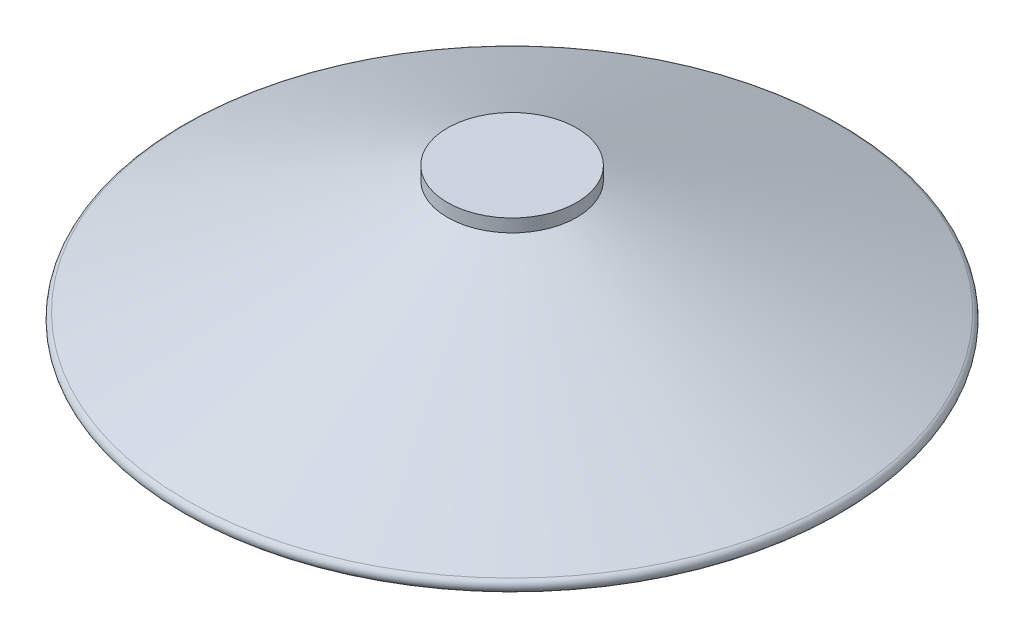
ISO-10303-21;
HEADER;
FILE_DESCRIPTION(('STEP AP214'),'2;1');
FILE_NAME('part.step','',(''),(''),'','','');
FILE_SCHEMA(('AUTOMOTIVE_DESIGN { 1 0 10303 214 1 1 1 1 }'));
ENDSEC;
DATA;
#1=APPLICATION_CONTEXT('core data for automotive mechanical design processes');
#2=APPLICATION_PROTOCOL_DEFINITION('international standard','automotive_design',2000,#1);
#3=PRODUCT_CONTEXT('',#1,'mechanical');
#4=PRODUCT('Part','Part','',(#3));
#5=PRODUCT_RELATED_PRODUCT_CATEGORY('part','',(#4));
#6=PRODUCT_DEFINITION_FORMATION('','',#4);
#7=PRODUCT_DEFINITION_CONTEXT('part definition',#1,'design');
#8=PRODUCT_DEFINITION('design','',#6,#7);
#9=PRODUCT_DEFINITION_SHAPE('','',#8);
#10=(LENGTH_UNIT() NAMED_UNIT(*) SI_UNIT(.MILLI.,.METRE.));
#11=(NAMED_UNIT(*) PLANE_ANGLE_UNIT() SI_UNIT($,.RADIAN.));
#12=(NAMED_UNIT(*) SI_UNIT($,.STERADIAN.) SOLID_ANGLE_UNIT());
#13=UNCERTAINTY_MEASURE_WITH_UNIT(LENGTH_MEASURE(1.E-05),#10,'distance_accuracy_value','');
#14=(GEOMETRIC_REPRESENTATION_CONTEXT(3) GLOBAL_UNCERTAINTY_ASSIGNED_CONTEXT((#13)) GLOBAL_UNIT_ASSIGNED_CONTEXT((#10,
#11,#12)) REPRESENTATION_CONTEXT('',''));
#15=CARTESIAN_POINT('',(0.,0.,0.));
#16=DIRECTION('',(0.,0.,1.));
#17=DIRECTION('',(1.,0.,0.));
#18=AXIS2_PLACEMENT_3D('',#15,#16,#17);
#19=CARTESIAN_POINT('',(0.,10.8,0.));
#20=DIRECTION('',(0.,1.,0.));
#21=DIRECTION('',(0.,0.,1.));
#22=AXIS2_PLACEMENT_3D('',#19,#20,#21);
#23=PLANE('',#22);
#24=CARTESIAN_POINT('',(0.,10.8,0.));
#25=DIRECTION('',(0.,1.,0.));
#26=DIRECTION('',(0.,0.,1.));
#27=AXIS2_PLACEMENT_3D('',#24,#25,#26);
#28=CIRCLE('',#27,5.);
#29=CARTESIAN_POINT('',(0.,10.8,5.));
#30=VERTEX_POINT('',#29);
#31=EDGE_CURVE('E10',#30,#30,#28,.T.);
#32=ORIENTED_EDGE('',*,*,#31,.T.);
#33=EDGE_LOOP('',(#32));
#34=FACE_BOUND('',#33,.T.);
#35=ADVANCED_FACE('F34',(#34),#23,.T.);
#36=CARTESIAN_POINT('',(0.,17.7201574060161,0.));
#37=DIRECTION('',(0.,1.,0.));
#38=DIRECTION('',(0.,0.,1.));
#39=AXIS2_PLACEMENT_3D('',#36,#37,#38);
#40=CYLINDRICAL_SURFACE('',#39,5.);
#41=CARTESIAN_POINT('',(0.,9.80000000000001,0.));
#42=DIRECTION('',(0.,1.,0.));
#43=DIRECTION('',(0.,0.,1.));
#44=AXIS2_PLACEMENT_3D('',#41,#42,#43);
#45=CIRCLE('',#44,5.);
#46=CARTESIAN_POINT('',(0.,9.80000000000001,5.));
#47=VERTEX_POINT('',#46);
#48=EDGE_CURVE('E40',#47,#47,#45,.T.);
#49=ORIENTED_EDGE('',*,*,#48,.T.);
#50=EDGE_LOOP('',(#49));
#51=FACE_BOUND('',#50,.T.);
#52=ORIENTED_EDGE('',*,*,#31,.F.);
#53=EDGE_LOOP('',(#52));
#54=FACE_BOUND('',#53,.T.);
#55=ADVANCED_FACE('F66',(#51,#54),#40,.T.);
#56=CARTESIAN_POINT('',(0.,9.80000000000001,0.));
#57=DIRECTION('',(0.,-1.,0.));
#58=DIRECTION('',(0.,0.,-1.));
#59=AXIS2_PLACEMENT_3D('',#56,#57,#58);
#60=CONICAL_SURFACE('',#59,5.,1.15820963158708);
#61=CARTESIAN_POINT('',(0.,0.958043337452783,0.));
#62=DIRECTION('',(0.,1.,0.));
#63=DIRECTION('',(0.,0.,1.));
#64=AXIS2_PLACEMENT_3D('',#61,#62,#63);
#65=CIRCLE('',#64,25.2004901519155);
#66=CARTESIAN_POINT('',(0.,0.958043337452783,25.2004901519155));
#67=VERTEX_POINT('',#66);
#68=EDGE_CURVE('E44',#67,#67,#65,.T.);
#69=ORIENTED_EDGE('',*,*,#68,.T.);
#70=EDGE_LOOP('',(#69));
#71=FACE_BOUND('',#70,.T.);
#72=ORIENTED_EDGE('',*,*,#48,.F.);
#73=EDGE_LOOP('',(#72));
#74=FACE_BOUND('',#73,.T.);
#75=ADVANCED_FACE('F63',(#71,#74),#60,.T.);
#76=CARTESIAN_POINT('',(0.,0.5,0.));
#77=DIRECTION('',(0.,1.,0.));
#78=DIRECTION('',(0.,0.,1.));
#79=AXIS2_PLACEMENT_3D('',#76,#77,#78);
#80=TOROIDAL_SURFACE('',#79,25.,0.500000000000001);
#81=CARTESIAN_POINT('',(0.,0.,0.));
#82=DIRECTION('',(0.,1.,0.));
#83=DIRECTION('',(0.,0.,1.));
#84=AXIS2_PLACEMENT_3D('',#81,#82,#83);
#85=CIRCLE('',#84,25.);
#86=CARTESIAN_POINT('',(0.,0.,25.));
#87=VERTEX_POINT('',#86);
#88=EDGE_CURVE('E48',#87,#87,#85,.T.);
#89=ORIENTED_EDGE('',*,*,#88,.T.);
#90=EDGE_LOOP('',(#89));
#91=FACE_BOUND('',#90,.T.);
#92=ORIENTED_EDGE('',*,*,#68,.F.);
#93=EDGE_LOOP('',(#92));
#94=FACE_BOUND('',#93,.T.);
#95=ADVANCED_FACE('F54',(#91,#94),#80,.T.);
#96=CARTESIAN_POINT('',(-25.,0.,0.));
#97=DIRECTION('',(0.,-1.,0.));
#98=DIRECTION('',(0.,0.,-1.));
#99=AXIS2_PLACEMENT_3D('',#96,#97,#98);
#100=PLANE('',#99);
#101=ORIENTED_EDGE('',*,*,#88,.F.);
#102=EDGE_LOOP('',(#101));
#103=FACE_BOUND('',#102,.T.);
#104=ADVANCED_FACE('F57',(#103),#100,.T.);
#105=CLOSED_SHELL('',(#35,#55,#75,#95,#104));
#106=MANIFOLD_SOLID_BREP('B2',#105);
#107=ADVANCED_BREP_SHAPE_REPRESENTATION('',(#18,#106),#14);
#108=SHAPE_DEFINITION_REPRESENTATION(#9,#107);
ENDSEC;
END-ISO-10303-21;
